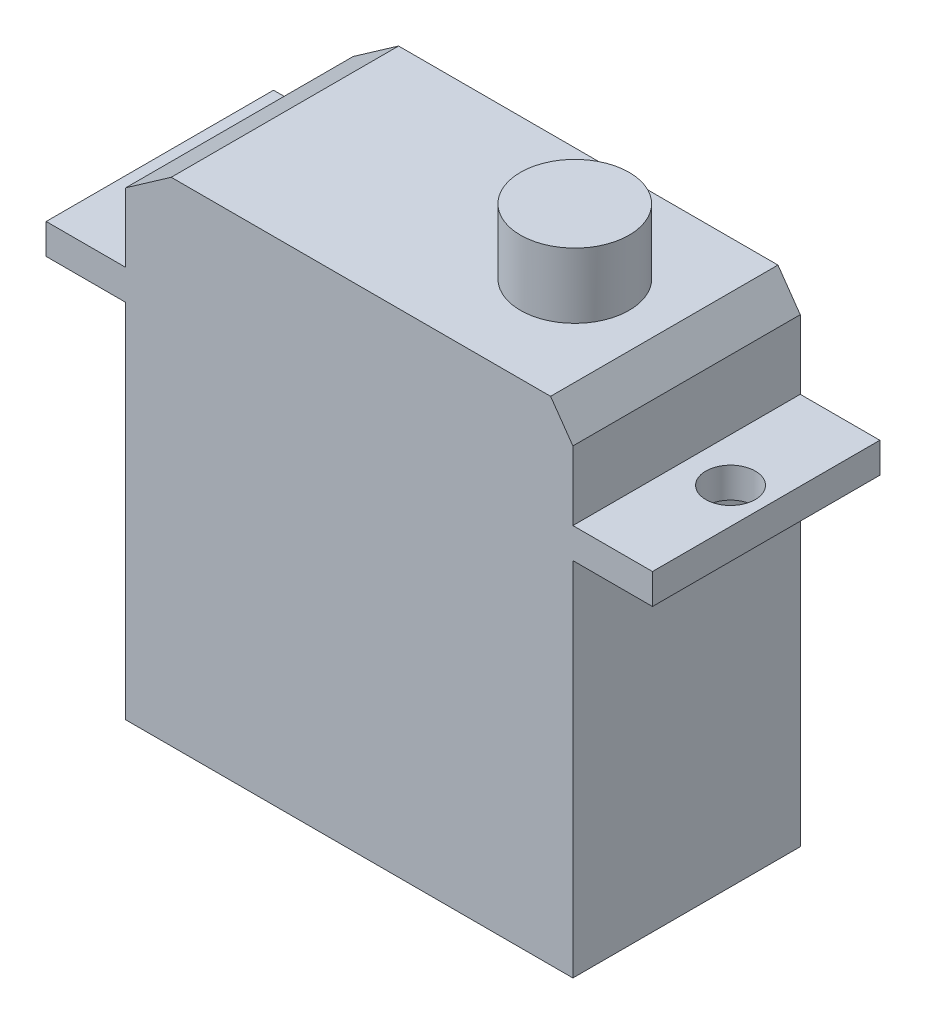
ISO-10303-21;
HEADER;
FILE_DESCRIPTION(('STEP AP214'),'2;1');
FILE_NAME('part.step','',(''),(''),'','','');
FILE_SCHEMA(('AUTOMOTIVE_DESIGN { 1 0 10303 214 1 1 1 1 }'));
ENDSEC;
DATA;
#1=APPLICATION_CONTEXT('core data for automotive mechanical design processes');
#2=APPLICATION_PROTOCOL_DEFINITION('international standard','automotive_design',2000,#1);
#3=PRODUCT_CONTEXT('',#1,'mechanical');
#4=PRODUCT('Part','Part','',(#3));
#5=PRODUCT_RELATED_PRODUCT_CATEGORY('part','',(#4));
#6=PRODUCT_DEFINITION_FORMATION('','',#4);
#7=PRODUCT_DEFINITION_CONTEXT('part definition',#1,'design');
#8=PRODUCT_DEFINITION('design','',#6,#7);
#9=PRODUCT_DEFINITION_SHAPE('','',#8);
#10=(LENGTH_UNIT() NAMED_UNIT(*) SI_UNIT(.MILLI.,.METRE.));
#11=(NAMED_UNIT(*) PLANE_ANGLE_UNIT() SI_UNIT($,.RADIAN.));
#12=(NAMED_UNIT(*) SI_UNIT($,.STERADIAN.) SOLID_ANGLE_UNIT());
#13=UNCERTAINTY_MEASURE_WITH_UNIT(LENGTH_MEASURE(1.E-05),#10,'distance_accuracy_value','');
#14=(GEOMETRIC_REPRESENTATION_CONTEXT(3) GLOBAL_UNCERTAINTY_ASSIGNED_CONTEXT((#13)) GLOBAL_UNIT_ASSIGNED_CONTEXT((#10,
#11,#12)) REPRESENTATION_CONTEXT('',''));
#15=CARTESIAN_POINT('',(0.,0.,0.));
#16=DIRECTION('',(0.,0.,1.));
#17=DIRECTION('',(1.,0.,0.));
#18=AXIS2_PLACEMENT_3D('',#15,#16,#17);
#19=CARTESIAN_POINT('',(20.,11.925,7.5));
#20=DIRECTION('',(0.,1.,0.));
#21=DIRECTION('',(0.,0.,1.));
#22=AXIS2_PLACEMENT_3D('',#19,#20,#21);
#23=PLANE('',#22);
#24=CARTESIAN_POINT('',(17.65,11.925,0.));
#25=DIRECTION('',(0.,1.,0.));
#26=DIRECTION('',(0.,0.,1.));
#27=AXIS2_PLACEMENT_3D('',#24,#25,#26);
#28=CIRCLE('',#27,1.63195);
#29=CARTESIAN_POINT('',(17.65,11.925,1.63194999999999));
#30=VERTEX_POINT('',#29);
#31=EDGE_CURVE('E311',#30,#30,#28,.T.);
#32=ORIENTED_EDGE('',*,*,#31,.T.);
#33=EDGE_LOOP('',(#32));
#34=FACE_BOUND('',#33,.T.);
#35=DIRECTION('',(1.,0.,0.));
#36=VECTOR('',#35,1.);
#37=CARTESIAN_POINT('',(20.,11.925,-7.5));
#38=LINE('',#37,#36);
#39=CARTESIAN_POINT('',(14.75,11.925,-7.5));
#40=VERTEX_POINT('',#39);
#41=CARTESIAN_POINT('',(20.,11.925,-7.5));
#42=VERTEX_POINT('',#41);
#43=EDGE_CURVE('E170',#40,#42,#38,.T.);
#44=ORIENTED_EDGE('',*,*,#43,.T.);
#45=DIRECTION('',(0.,0.,-1.));
#46=VECTOR('',#45,1.);
#47=CARTESIAN_POINT('',(20.,11.925,7.5));
#48=LINE('',#47,#46);
#49=CARTESIAN_POINT('',(20.,11.925,7.5));
#50=VERTEX_POINT('',#49);
#51=EDGE_CURVE('E45',#50,#42,#48,.T.);
#52=ORIENTED_EDGE('',*,*,#51,.F.);
#53=DIRECTION('',(1.,0.,0.));
#54=VECTOR('',#53,1.);
#55=CARTESIAN_POINT('',(20.,11.925,7.5));
#56=LINE('',#55,#54);
#57=CARTESIAN_POINT('',(14.75,11.925,7.5));
#58=VERTEX_POINT('',#57);
#59=EDGE_CURVE('E197',#58,#50,#56,.T.);
#60=ORIENTED_EDGE('',*,*,#59,.F.);
#61=DIRECTION('',(0.,0.,-1.));
#62=VECTOR('',#61,1.);
#63=CARTESIAN_POINT('',(14.75,11.925,7.5));
#64=LINE('',#63,#62);
#65=EDGE_CURVE('E166',#58,#40,#64,.T.);
#66=ORIENTED_EDGE('',*,*,#65,.T.);
#67=EDGE_LOOP('',(#44,#52,#60,#66));
#68=FACE_BOUND('',#67,.T.);
#69=ADVANCED_FACE('F36',(#34,#68),#23,.F.);
#70=CARTESIAN_POINT('',(20.,13.925,7.5));
#71=DIRECTION('',(-1.,0.,0.));
#72=DIRECTION('',(0.,0.,1.));
#73=AXIS2_PLACEMENT_3D('',#70,#71,#72);
#74=PLANE('',#73);
#75=DIRECTION('',(0.,1.,0.));
#76=VECTOR('',#75,1.);
#77=CARTESIAN_POINT('',(20.,13.925,-7.5));
#78=LINE('',#77,#76);
#79=CARTESIAN_POINT('',(20.,13.925,-7.5));
#80=VERTEX_POINT('',#79);
#81=EDGE_CURVE('E173',#42,#80,#78,.T.);
#82=ORIENTED_EDGE('',*,*,#81,.T.);
#83=DIRECTION('',(0.,0.,-1.));
#84=VECTOR('',#83,1.);
#85=CARTESIAN_POINT('',(20.,13.925,7.5));
#86=LINE('',#85,#84);
#87=CARTESIAN_POINT('',(20.,13.925,7.5));
#88=VERTEX_POINT('',#87);
#89=EDGE_CURVE('E225',#88,#80,#86,.T.);
#90=ORIENTED_EDGE('',*,*,#89,.F.);
#91=DIRECTION('',(0.,1.,0.));
#92=VECTOR('',#91,1.);
#93=CARTESIAN_POINT('',(20.,13.925,7.5));
#94=LINE('',#93,#92);
#95=EDGE_CURVE('E115',#50,#88,#94,.T.);
#96=ORIENTED_EDGE('',*,*,#95,.F.);
#97=ORIENTED_EDGE('',*,*,#51,.T.);
#98=EDGE_LOOP('',(#82,#90,#96,#97));
#99=FACE_BOUND('',#98,.T.);
#100=ADVANCED_FACE('F229',(#99),#74,.F.);
#101=CARTESIAN_POINT('',(14.75,13.925,7.5));
#102=DIRECTION('',(0.,-1.,0.));
#103=DIRECTION('',(0.,0.,-1.));
#104=AXIS2_PLACEMENT_3D('',#101,#102,#103);
#105=PLANE('',#104);
#106=CARTESIAN_POINT('',(17.65,13.925,0.));
#107=DIRECTION('',(0.,1.,0.));
#108=DIRECTION('',(0.,0.,1.));
#109=AXIS2_PLACEMENT_3D('',#106,#107,#108);
#110=CIRCLE('',#109,1.63195);
#111=CARTESIAN_POINT('',(17.65,13.925,1.63194999999999));
#112=VERTEX_POINT('',#111);
#113=EDGE_CURVE('E313',#112,#112,#110,.T.);
#114=ORIENTED_EDGE('',*,*,#113,.F.);
#115=EDGE_LOOP('',(#114));
#116=FACE_BOUND('',#115,.T.);
#117=DIRECTION('',(-1.,0.,0.));
#118=VECTOR('',#117,1.);
#119=CARTESIAN_POINT('',(14.75,13.925,-7.5));
#120=LINE('',#119,#118);
#121=CARTESIAN_POINT('',(14.75,13.925,-7.5));
#122=VERTEX_POINT('',#121);
#123=EDGE_CURVE('E176',#80,#122,#120,.T.);
#124=ORIENTED_EDGE('',*,*,#123,.T.);
#125=DIRECTION('',(0.,0.,-1.));
#126=VECTOR('',#125,1.);
#127=CARTESIAN_POINT('',(14.75,13.925,7.5));
#128=LINE('',#127,#126);
#129=CARTESIAN_POINT('',(14.75,13.925,7.5));
#130=VERTEX_POINT('',#129);
#131=EDGE_CURVE('E222',#130,#122,#128,.T.);
#132=ORIENTED_EDGE('',*,*,#131,.F.);
#133=DIRECTION('',(-1.,0.,0.));
#134=VECTOR('',#133,1.);
#135=CARTESIAN_POINT('',(14.75,13.925,7.5));
#136=LINE('',#135,#134);
#137=EDGE_CURVE('E249',#88,#130,#136,.T.);
#138=ORIENTED_EDGE('',*,*,#137,.F.);
#139=ORIENTED_EDGE('',*,*,#89,.T.);
#140=EDGE_LOOP('',(#124,#132,#138,#139));
#141=FACE_BOUND('',#140,.T.);
#142=ADVANCED_FACE('F240',(#116,#141),#105,.F.);
#143=CARTESIAN_POINT('',(14.75,18.4743773853709,7.5));
#144=DIRECTION('',(-1.,0.,0.));
#145=DIRECTION('',(0.,0.,1.));
#146=AXIS2_PLACEMENT_3D('',#143,#144,#145);
#147=PLANE('',#146);
#148=DIRECTION('',(0.,1.,0.));
#149=VECTOR('',#148,1.);
#150=CARTESIAN_POINT('',(14.75,18.4743773853709,-7.5));
#151=LINE('',#150,#149);
#152=CARTESIAN_POINT('',(14.75,18.4743773853709,-7.5));
#153=VERTEX_POINT('',#152);
#154=EDGE_CURVE('E178',#122,#153,#151,.T.);
#155=ORIENTED_EDGE('',*,*,#154,.T.);
#156=DIRECTION('',(0.,0.,-1.));
#157=VECTOR('',#156,1.);
#158=CARTESIAN_POINT('',(14.75,18.4743773853709,7.5));
#159=LINE('',#158,#157);
#160=CARTESIAN_POINT('',(14.75,18.4743773853709,7.5));
#161=VERTEX_POINT('',#160);
#162=EDGE_CURVE('E219',#161,#153,#159,.T.);
#163=ORIENTED_EDGE('',*,*,#162,.F.);
#164=DIRECTION('',(0.,1.,0.));
#165=VECTOR('',#164,1.);
#166=CARTESIAN_POINT('',(14.75,18.4743773853709,7.5));
#167=LINE('',#166,#165);
#168=EDGE_CURVE('E246',#130,#161,#167,.T.);
#169=ORIENTED_EDGE('',*,*,#168,.F.);
#170=ORIENTED_EDGE('',*,*,#131,.T.);
#171=EDGE_LOOP('',(#155,#163,#169,#170));
#172=FACE_BOUND('',#171,.T.);
#173=ADVANCED_FACE('F244',(#172),#147,.F.);
#174=CARTESIAN_POINT('',(13.2791282103029,20.575,7.5));
#175=DIRECTION('',(-0.819152044288992,-0.573576436351045,0.));
#176=DIRECTION('',(0.573576436351045,-0.819152044288993,0.));
#177=AXIS2_PLACEMENT_3D('',#174,#175,#176);
#178=PLANE('',#177);
#179=DIRECTION('',(-0.573576436351045,0.819152044288992,0.));
#180=VECTOR('',#179,1.);
#181=CARTESIAN_POINT('',(13.2791282103029,20.575,-7.5));
#182=LINE('',#181,#180);
#183=CARTESIAN_POINT('',(13.2791282103029,20.575,-7.5));
#184=VERTEX_POINT('',#183);
#185=EDGE_CURVE('E180',#153,#184,#182,.T.);
#186=ORIENTED_EDGE('',*,*,#185,.T.);
#187=DIRECTION('',(0.,0.,-1.));
#188=VECTOR('',#187,1.);
#189=CARTESIAN_POINT('',(13.2791282103029,20.575,7.5));
#190=LINE('',#189,#188);
#191=CARTESIAN_POINT('',(13.2791282103029,20.575,7.5));
#192=VERTEX_POINT('',#191);
#193=EDGE_CURVE('E216',#192,#184,#190,.T.);
#194=ORIENTED_EDGE('',*,*,#193,.F.);
#195=DIRECTION('',(-0.573576436351045,0.819152044288992,0.));
#196=VECTOR('',#195,1.);
#197=CARTESIAN_POINT('',(13.2791282103029,20.575,7.5));
#198=LINE('',#197,#196);
#199=EDGE_CURVE('E248',#161,#192,#198,.T.);
#200=ORIENTED_EDGE('',*,*,#199,.F.);
#201=ORIENTED_EDGE('',*,*,#162,.T.);
#202=EDGE_LOOP('',(#186,#194,#200,#201));
#203=FACE_BOUND('',#202,.T.);
#204=ADVANCED_FACE('F294',(#203),#178,.F.);
#205=CARTESIAN_POINT('',(-11.75,20.575,7.5));
#206=DIRECTION('',(0.,-1.,0.));
#207=DIRECTION('',(0.,0.,-1.));
#208=AXIS2_PLACEMENT_3D('',#205,#206,#207);
#209=PLANE('',#208);
#210=CARTESIAN_POINT('',(7.375,20.575,0.));
#211=DIRECTION('',(0.,-1.,0.));
#212=DIRECTION('',(0.,0.,-1.));
#213=AXIS2_PLACEMENT_3D('',#210,#211,#212);
#214=CIRCLE('',#213,3.587141306582);
#215=CARTESIAN_POINT('',(7.375,20.575,-3.587141306582));
#216=VERTEX_POINT('',#215);
#217=EDGE_CURVE('E11',#216,#216,#214,.F.);
#218=ORIENTED_EDGE('',*,*,#217,.F.);
#219=EDGE_LOOP('',(#218));
#220=FACE_BOUND('',#219,.T.);
#221=DIRECTION('',(-1.,0.,0.));
#222=VECTOR('',#221,1.);
#223=CARTESIAN_POINT('',(-11.75,20.575,-7.5));
#224=LINE('',#223,#222);
#225=CARTESIAN_POINT('',(-11.75,20.575,-7.5));
#226=VERTEX_POINT('',#225);
#227=EDGE_CURVE('E182',#184,#226,#224,.T.);
#228=ORIENTED_EDGE('',*,*,#227,.T.);
#229=DIRECTION('',(0.,0.,-1.));
#230=VECTOR('',#229,1.);
#231=CARTESIAN_POINT('',(-11.75,20.575,7.5));
#232=LINE('',#231,#230);
#233=CARTESIAN_POINT('',(-11.75,20.575,7.5));
#234=VERTEX_POINT('',#233);
#235=EDGE_CURVE('E213',#234,#226,#232,.T.);
#236=ORIENTED_EDGE('',*,*,#235,.F.);
#237=DIRECTION('',(-1.,0.,0.));
#238=VECTOR('',#237,1.);
#239=CARTESIAN_POINT('',(-11.75,20.575,7.5));
#240=LINE('',#239,#238);
#241=EDGE_CURVE('E251',#192,#234,#240,.T.);
#242=ORIENTED_EDGE('',*,*,#241,.F.);
#243=ORIENTED_EDGE('',*,*,#193,.T.);
#244=EDGE_LOOP('',(#228,#236,#242,#243));
#245=FACE_BOUND('',#244,.T.);
#246=ADVANCED_FACE('F290',(#220,#245),#209,.F.);
#247=CARTESIAN_POINT('',(-14.75,18.4743773853709,7.5));
#248=DIRECTION('',(0.573576436351045,-0.819152044288992,0.));
#249=DIRECTION('',(0.819152044288993,0.573576436351045,0.));
#250=AXIS2_PLACEMENT_3D('',#247,#248,#249);
#251=PLANE('',#250);
#252=DIRECTION('',(-0.819152044288992,-0.573576436351045,0.));
#253=VECTOR('',#252,1.);
#254=CARTESIAN_POINT('',(-14.75,18.4743773853709,-7.5));
#255=LINE('',#254,#253);
#256=CARTESIAN_POINT('',(-14.75,18.4743773853709,-7.5));
#257=VERTEX_POINT('',#256);
#258=EDGE_CURVE('E184',#226,#257,#255,.T.);
#259=ORIENTED_EDGE('',*,*,#258,.T.);
#260=DIRECTION('',(0.,0.,-1.));
#261=VECTOR('',#260,1.);
#262=CARTESIAN_POINT('',(-14.75,18.4743773853709,7.5));
#263=LINE('',#262,#261);
#264=CARTESIAN_POINT('',(-14.75,18.4743773853709,7.5));
#265=VERTEX_POINT('',#264);
#266=EDGE_CURVE('E210',#265,#257,#263,.T.);
#267=ORIENTED_EDGE('',*,*,#266,.F.);
#268=DIRECTION('',(-0.819152044288992,-0.573576436351045,0.));
#269=VECTOR('',#268,1.);
#270=CARTESIAN_POINT('',(-14.75,18.4743773853709,7.5));
#271=LINE('',#270,#269);
#272=EDGE_CURVE('E257',#234,#265,#271,.T.);
#273=ORIENTED_EDGE('',*,*,#272,.F.);
#274=ORIENTED_EDGE('',*,*,#235,.T.);
#275=EDGE_LOOP('',(#259,#267,#273,#274));
#276=FACE_BOUND('',#275,.T.);
#277=ADVANCED_FACE('F286',(#276),#251,.F.);
#278=CARTESIAN_POINT('',(-14.75,13.925,7.5));
#279=DIRECTION('',(1.,0.,0.));
#280=DIRECTION('',(0.,0.,-1.));
#281=AXIS2_PLACEMENT_3D('',#278,#279,#280);
#282=PLANE('',#281);
#283=DIRECTION('',(0.,-1.,0.));
#284=VECTOR('',#283,1.);
#285=CARTESIAN_POINT('',(-14.75,13.925,-7.5));
#286=LINE('',#285,#284);
#287=CARTESIAN_POINT('',(-14.75,13.925,-7.5));
#288=VERTEX_POINT('',#287);
#289=EDGE_CURVE('E186',#257,#288,#286,.T.);
#290=ORIENTED_EDGE('',*,*,#289,.T.);
#291=DIRECTION('',(0.,0.,-1.));
#292=VECTOR('',#291,1.);
#293=CARTESIAN_POINT('',(-14.75,13.925,7.5));
#294=LINE('',#293,#292);
#295=CARTESIAN_POINT('',(-14.75,13.925,7.5));
#296=VERTEX_POINT('',#295);
#297=EDGE_CURVE('E207',#296,#288,#294,.T.);
#298=ORIENTED_EDGE('',*,*,#297,.F.);
#299=DIRECTION('',(0.,-1.,0.));
#300=VECTOR('',#299,1.);
#301=CARTESIAN_POINT('',(-14.75,13.925,7.5));
#302=LINE('',#301,#300);
#303=EDGE_CURVE('E259',#265,#296,#302,.T.);
#304=ORIENTED_EDGE('',*,*,#303,.F.);
#305=ORIENTED_EDGE('',*,*,#266,.T.);
#306=EDGE_LOOP('',(#290,#298,#304,#305));
#307=FACE_BOUND('',#306,.T.);
#308=ADVANCED_FACE('F282',(#307),#282,.F.);
#309=CARTESIAN_POINT('',(-20.,13.925,7.5));
#310=DIRECTION('',(0.,-1.,0.));
#311=DIRECTION('',(0.,0.,-1.));
#312=AXIS2_PLACEMENT_3D('',#309,#310,#311);
#313=PLANE('',#312);
#314=CARTESIAN_POINT('',(-17.65,13.925,0.));
#315=DIRECTION('',(0.,1.,0.));
#316=DIRECTION('',(0.,0.,1.));
#317=AXIS2_PLACEMENT_3D('',#314,#315,#316);
#318=CIRCLE('',#317,1.63195);
#319=CARTESIAN_POINT('',(-17.65,13.925,1.63195));
#320=VERTEX_POINT('',#319);
#321=EDGE_CURVE('E321',#320,#320,#318,.T.);
#322=ORIENTED_EDGE('',*,*,#321,.F.);
#323=EDGE_LOOP('',(#322));
#324=FACE_BOUND('',#323,.T.);
#325=DIRECTION('',(-1.,0.,0.));
#326=VECTOR('',#325,1.);
#327=CARTESIAN_POINT('',(-20.,13.925,-7.5));
#328=LINE('',#327,#326);
#329=CARTESIAN_POINT('',(-20.,13.925,-7.5));
#330=VERTEX_POINT('',#329);
#331=EDGE_CURVE('E188',#288,#330,#328,.T.);
#332=ORIENTED_EDGE('',*,*,#331,.T.);
#333=DIRECTION('',(0.,0.,-1.));
#334=VECTOR('',#333,1.);
#335=CARTESIAN_POINT('',(-20.,13.925,7.5));
#336=LINE('',#335,#334);
#337=CARTESIAN_POINT('',(-20.,13.925,7.5));
#338=VERTEX_POINT('',#337);
#339=EDGE_CURVE('E204',#338,#330,#336,.T.);
#340=ORIENTED_EDGE('',*,*,#339,.F.);
#341=DIRECTION('',(-1.,0.,0.));
#342=VECTOR('',#341,1.);
#343=CARTESIAN_POINT('',(-20.,13.925,7.5));
#344=LINE('',#343,#342);
#345=EDGE_CURVE('E261',#296,#338,#344,.T.);
#346=ORIENTED_EDGE('',*,*,#345,.F.);
#347=ORIENTED_EDGE('',*,*,#297,.T.);
#348=EDGE_LOOP('',(#332,#340,#346,#347));
#349=FACE_BOUND('',#348,.T.);
#350=ADVANCED_FACE('F278',(#324,#349),#313,.F.);
#351=CARTESIAN_POINT('',(-20.,11.925,7.5));
#352=DIRECTION('',(1.,0.,0.));
#353=DIRECTION('',(0.,0.,-1.));
#354=AXIS2_PLACEMENT_3D('',#351,#352,#353);
#355=PLANE('',#354);
#356=DIRECTION('',(0.,-1.,0.));
#357=VECTOR('',#356,1.);
#358=CARTESIAN_POINT('',(-20.,11.925,-7.5));
#359=LINE('',#358,#357);
#360=CARTESIAN_POINT('',(-20.,11.925,-7.5));
#361=VERTEX_POINT('',#360);
#362=EDGE_CURVE('E190',#330,#361,#359,.T.);
#363=ORIENTED_EDGE('',*,*,#362,.T.);
#364=DIRECTION('',(0.,0.,-1.));
#365=VECTOR('',#364,1.);
#366=CARTESIAN_POINT('',(-20.,11.925,7.5));
#367=LINE('',#366,#365);
#368=CARTESIAN_POINT('',(-20.,11.925,7.5));
#369=VERTEX_POINT('',#368);
#370=EDGE_CURVE('E201',#369,#361,#367,.T.);
#371=ORIENTED_EDGE('',*,*,#370,.F.);
#372=DIRECTION('',(0.,-1.,0.));
#373=VECTOR('',#372,1.);
#374=CARTESIAN_POINT('',(-20.,11.925,7.5));
#375=LINE('',#374,#373);
#376=EDGE_CURVE('E263',#338,#369,#375,.T.);
#377=ORIENTED_EDGE('',*,*,#376,.F.);
#378=ORIENTED_EDGE('',*,*,#339,.T.);
#379=EDGE_LOOP('',(#363,#371,#377,#378));
#380=FACE_BOUND('',#379,.T.);
#381=ADVANCED_FACE('F269',(#380),#355,.F.);
#382=CARTESIAN_POINT('',(-14.75,11.925,7.5));
#383=DIRECTION('',(0.,1.,0.));
#384=DIRECTION('',(-1.,0.,0.));
#385=AXIS2_PLACEMENT_3D('',#382,#383,#384);
#386=PLANE('',#385);
#387=CARTESIAN_POINT('',(-17.65,11.925,0.));
#388=DIRECTION('',(0.,1.,0.));
#389=DIRECTION('',(-1.,0.,0.));
#390=AXIS2_PLACEMENT_3D('',#387,#388,#389);
#391=CIRCLE('',#390,1.63195);
#392=CARTESIAN_POINT('',(-19.28195,11.925,0.));
#393=VERTEX_POINT('',#392);
#394=EDGE_CURVE('E39',#393,#393,#391,.T.);
#395=ORIENTED_EDGE('',*,*,#394,.T.);
#396=EDGE_LOOP('',(#395));
#397=FACE_BOUND('',#396,.T.);
#398=DIRECTION('',(1.,0.,0.));
#399=VECTOR('',#398,1.);
#400=CARTESIAN_POINT('',(-14.75,11.925,-7.5));
#401=LINE('',#400,#399);
#402=CARTESIAN_POINT('',(-14.75,11.925,-7.5));
#403=VERTEX_POINT('',#402);
#404=EDGE_CURVE('E192',#361,#403,#401,.T.);
#405=ORIENTED_EDGE('',*,*,#404,.T.);
#406=DIRECTION('',(0.,0.,-1.));
#407=VECTOR('',#406,1.);
#408=CARTESIAN_POINT('',(-14.75,11.925,7.5));
#409=LINE('',#408,#407);
#410=CARTESIAN_POINT('',(-14.75,11.925,7.5));
#411=VERTEX_POINT('',#410);
#412=EDGE_CURVE('E161',#411,#403,#409,.T.);
#413=ORIENTED_EDGE('',*,*,#412,.F.);
#414=DIRECTION('',(1.,0.,0.));
#415=VECTOR('',#414,1.);
#416=CARTESIAN_POINT('',(-14.75,11.925,7.5));
#417=LINE('',#416,#415);
#418=EDGE_CURVE('E152',#369,#411,#417,.T.);
#419=ORIENTED_EDGE('',*,*,#418,.F.);
#420=ORIENTED_EDGE('',*,*,#370,.T.);
#421=EDGE_LOOP('',(#405,#413,#419,#420));
#422=FACE_BOUND('',#421,.T.);
#423=ADVANCED_FACE('F273',(#397,#422),#386,.F.);
#424=CARTESIAN_POINT('',(-14.75,-11.925,7.5));
#425=DIRECTION('',(1.,0.,0.));
#426=DIRECTION('',(0.,0.,-1.));
#427=AXIS2_PLACEMENT_3D('',#424,#425,#426);
#428=PLANE('',#427);
#429=DIRECTION('',(0.,-1.,0.));
#430=VECTOR('',#429,1.);
#431=CARTESIAN_POINT('',(-14.75,-11.925,-7.5));
#432=LINE('',#431,#430);
#433=CARTESIAN_POINT('',(-14.75,-11.925,-7.5));
#434=VERTEX_POINT('',#433);
#435=EDGE_CURVE('E160',#403,#434,#432,.T.);
#436=ORIENTED_EDGE('',*,*,#435,.T.);
#437=DIRECTION('',(0.,0.,-1.));
#438=VECTOR('',#437,1.);
#439=CARTESIAN_POINT('',(-14.75,-11.925,7.5));
#440=LINE('',#439,#438);
#441=CARTESIAN_POINT('',(-14.75,-11.925,7.5));
#442=VERTEX_POINT('',#441);
#443=EDGE_CURVE('E157',#442,#434,#440,.T.);
#444=ORIENTED_EDGE('',*,*,#443,.F.);
#445=DIRECTION('',(0.,-1.,0.));
#446=VECTOR('',#445,1.);
#447=CARTESIAN_POINT('',(-14.75,-11.925,7.5));
#448=LINE('',#447,#446);
#449=EDGE_CURVE('E146',#411,#442,#448,.T.);
#450=ORIENTED_EDGE('',*,*,#449,.F.);
#451=ORIENTED_EDGE('',*,*,#412,.T.);
#452=EDGE_LOOP('',(#436,#444,#450,#451));
#453=FACE_BOUND('',#452,.T.);
#454=ADVANCED_FACE('F158',(#453),#428,.F.);
#455=CARTESIAN_POINT('',(-14.75,-11.925,7.5));
#456=DIRECTION('',(0.,1.,0.));
#457=DIRECTION('',(0.,0.,1.));
#458=AXIS2_PLACEMENT_3D('',#455,#456,#457);
#459=PLANE('',#458);
#460=DIRECTION('',(1.,0.,0.));
#461=VECTOR('',#460,1.);
#462=CARTESIAN_POINT('',(-14.75,-11.925,-7.5));
#463=LINE('',#462,#461);
#464=CARTESIAN_POINT('',(14.75,-11.925,-7.5));
#465=VERTEX_POINT('',#464);
#466=EDGE_CURVE('E100',#434,#465,#463,.T.);
#467=ORIENTED_EDGE('',*,*,#466,.T.);
#468=DIRECTION('',(0.,0.,-1.));
#469=VECTOR('',#468,1.);
#470=CARTESIAN_POINT('',(14.75,-11.925,7.5));
#471=LINE('',#470,#469);
#472=CARTESIAN_POINT('',(14.75,-11.925,7.5));
#473=VERTEX_POINT('',#472);
#474=EDGE_CURVE('E162',#473,#465,#471,.T.);
#475=ORIENTED_EDGE('',*,*,#474,.F.);
#476=DIRECTION('',(1.,0.,0.));
#477=VECTOR('',#476,1.);
#478=CARTESIAN_POINT('',(-14.75,-11.925,7.5));
#479=LINE('',#478,#477);
#480=EDGE_CURVE('E150',#442,#473,#479,.T.);
#481=ORIENTED_EDGE('',*,*,#480,.F.);
#482=ORIENTED_EDGE('',*,*,#443,.T.);
#483=EDGE_LOOP('',(#467,#475,#481,#482));
#484=FACE_BOUND('',#483,.T.);
#485=ADVANCED_FACE('F164',(#484),#459,.F.);
#486=CARTESIAN_POINT('',(14.75,-11.925,7.5));
#487=DIRECTION('',(-1.,0.,0.));
#488=DIRECTION('',(0.,0.,1.));
#489=AXIS2_PLACEMENT_3D('',#486,#487,#488);
#490=PLANE('',#489);
#491=DIRECTION('',(0.,1.,0.));
#492=VECTOR('',#491,1.);
#493=CARTESIAN_POINT('',(14.75,-11.925,-7.5));
#494=LINE('',#493,#492);
#495=EDGE_CURVE('E106',#465,#40,#494,.T.);
#496=ORIENTED_EDGE('',*,*,#495,.T.);
#497=ORIENTED_EDGE('',*,*,#65,.F.);
#498=DIRECTION('',(0.,1.,0.));
#499=VECTOR('',#498,1.);
#500=CARTESIAN_POINT('',(14.75,-11.925,7.5));
#501=LINE('',#500,#499);
#502=EDGE_CURVE('E53',#473,#58,#501,.T.);
#503=ORIENTED_EDGE('',*,*,#502,.F.);
#504=ORIENTED_EDGE('',*,*,#474,.T.);
#505=EDGE_LOOP('',(#496,#497,#503,#504));
#506=FACE_BOUND('',#505,.T.);
#507=ADVANCED_FACE('F349',(#506),#490,.F.);
#508=CARTESIAN_POINT('',(0.,0.,7.5));
#509=DIRECTION('',(0.,0.,-1.));
#510=DIRECTION('',(-1.,0.,0.));
#511=AXIS2_PLACEMENT_3D('',#508,#509,#510);
#512=PLANE('',#511);
#513=ORIENTED_EDGE('',*,*,#59,.T.);
#514=ORIENTED_EDGE('',*,*,#95,.T.);
#515=ORIENTED_EDGE('',*,*,#137,.T.);
#516=ORIENTED_EDGE('',*,*,#168,.T.);
#517=ORIENTED_EDGE('',*,*,#199,.T.);
#518=ORIENTED_EDGE('',*,*,#241,.T.);
#519=ORIENTED_EDGE('',*,*,#272,.T.);
#520=ORIENTED_EDGE('',*,*,#303,.T.);
#521=ORIENTED_EDGE('',*,*,#345,.T.);
#522=ORIENTED_EDGE('',*,*,#376,.T.);
#523=ORIENTED_EDGE('',*,*,#418,.T.);
#524=ORIENTED_EDGE('',*,*,#449,.T.);
#525=ORIENTED_EDGE('',*,*,#480,.T.);
#526=ORIENTED_EDGE('',*,*,#502,.T.);
#527=EDGE_LOOP('',(#513,#514,#515,#516,#517,#518,#519,#520,#521,#522,#523,#524,#525,#526));
#528=FACE_BOUND('',#527,.T.);
#529=ADVANCED_FACE('F148',(#528),#512,.F.);
#530=CARTESIAN_POINT('',(0.,0.,-7.5));
#531=DIRECTION('',(0.,0.,-1.));
#532=DIRECTION('',(-1.,0.,0.));
#533=AXIS2_PLACEMENT_3D('',#530,#531,#532);
#534=PLANE('',#533);
#535=ORIENTED_EDGE('',*,*,#43,.F.);
#536=ORIENTED_EDGE('',*,*,#495,.F.);
#537=ORIENTED_EDGE('',*,*,#466,.F.);
#538=ORIENTED_EDGE('',*,*,#435,.F.);
#539=ORIENTED_EDGE('',*,*,#404,.F.);
#540=ORIENTED_EDGE('',*,*,#362,.F.);
#541=ORIENTED_EDGE('',*,*,#331,.F.);
#542=ORIENTED_EDGE('',*,*,#289,.F.);
#543=ORIENTED_EDGE('',*,*,#258,.F.);
#544=ORIENTED_EDGE('',*,*,#227,.F.);
#545=ORIENTED_EDGE('',*,*,#185,.F.);
#546=ORIENTED_EDGE('',*,*,#154,.F.);
#547=ORIENTED_EDGE('',*,*,#123,.F.);
#548=ORIENTED_EDGE('',*,*,#81,.F.);
#549=EDGE_LOOP('',(#535,#536,#537,#538,#539,#540,#541,#542,#543,#544,#545,#546,#547,#548));
#550=FACE_BOUND('',#549,.T.);
#551=ADVANCED_FACE('F234',(#550),#534,.T.);
#552=CARTESIAN_POINT('',(7.375,24.875,0.));
#553=DIRECTION('',(0.,-1.,0.));
#554=DIRECTION('',(0.,0.,-1.));
#555=AXIS2_PLACEMENT_3D('',#552,#553,#554);
#556=CYLINDRICAL_SURFACE('',#555,3.587141306582);
#557=CARTESIAN_POINT('',(7.375,24.875,0.));
#558=DIRECTION('',(0.,1.,0.));
#559=DIRECTION('',(0.,0.,1.));
#560=AXIS2_PLACEMENT_3D('',#557,#558,#559);
#561=CIRCLE('',#560,3.587141306582);
#562=CARTESIAN_POINT('',(7.375,24.875,3.587141306582));
#563=VERTEX_POINT('',#562);
#564=EDGE_CURVE('E174',#563,#563,#561,.T.);
#565=ORIENTED_EDGE('',*,*,#564,.F.);
#566=EDGE_LOOP('',(#565));
#567=FACE_BOUND('',#566,.T.);
#568=ORIENTED_EDGE('',*,*,#217,.T.);
#569=EDGE_LOOP('',(#568));
#570=FACE_BOUND('',#569,.T.);
#571=ADVANCED_FACE('F342',(#567,#570),#556,.T.);
#572=CARTESIAN_POINT('',(7.375,24.875,0.));
#573=DIRECTION('',(0.,1.,0.));
#574=DIRECTION('',(0.,0.,1.));
#575=AXIS2_PLACEMENT_3D('',#572,#573,#574);
#576=PLANE('',#575);
#577=ORIENTED_EDGE('',*,*,#564,.T.);
#578=EDGE_LOOP('',(#577));
#579=FACE_BOUND('',#578,.T.);
#580=ADVANCED_FACE('F336',(#579),#576,.T.);
#581=CARTESIAN_POINT('',(17.65,13.925,0.));
#582=DIRECTION('',(0.,1.,0.));
#583=DIRECTION('',(0.,0.,1.));
#584=AXIS2_PLACEMENT_3D('',#581,#582,#583);
#585=CYLINDRICAL_SURFACE('',#584,1.63195);
#586=ORIENTED_EDGE('',*,*,#113,.T.);
#587=EDGE_LOOP('',(#586));
#588=FACE_BOUND('',#587,.T.);
#589=ORIENTED_EDGE('',*,*,#31,.F.);
#590=EDGE_LOOP('',(#589));
#591=FACE_BOUND('',#590,.T.);
#592=ADVANCED_FACE('F331',(#588,#591),#585,.F.);
#593=CARTESIAN_POINT('',(-17.65,13.925,0.));
#594=DIRECTION('',(0.,1.,0.));
#595=DIRECTION('',(0.,0.,1.));
#596=AXIS2_PLACEMENT_3D('',#593,#594,#595);
#597=CYLINDRICAL_SURFACE('',#596,1.63195);
#598=ORIENTED_EDGE('',*,*,#321,.T.);
#599=EDGE_LOOP('',(#598));
#600=FACE_BOUND('',#599,.T.);
#601=ORIENTED_EDGE('',*,*,#394,.F.);
#602=EDGE_LOOP('',(#601));
#603=FACE_BOUND('',#602,.T.);
#604=ADVANCED_FACE('F329',(#600,#603),#597,.F.);
#605=CLOSED_SHELL('',(#69,#100,#142,#173,#204,#246,#277,#308,#350,#381,#423,#454,#485,#507,#529,
#551,#571,#580,#592,#604));
#606=MANIFOLD_SOLID_BREP('B2',#605);
#607=ADVANCED_BREP_SHAPE_REPRESENTATION('',(#18,#606),#14);
#608=SHAPE_DEFINITION_REPRESENTATION(#9,#607);
ENDSEC;
END-ISO-10303-21;
